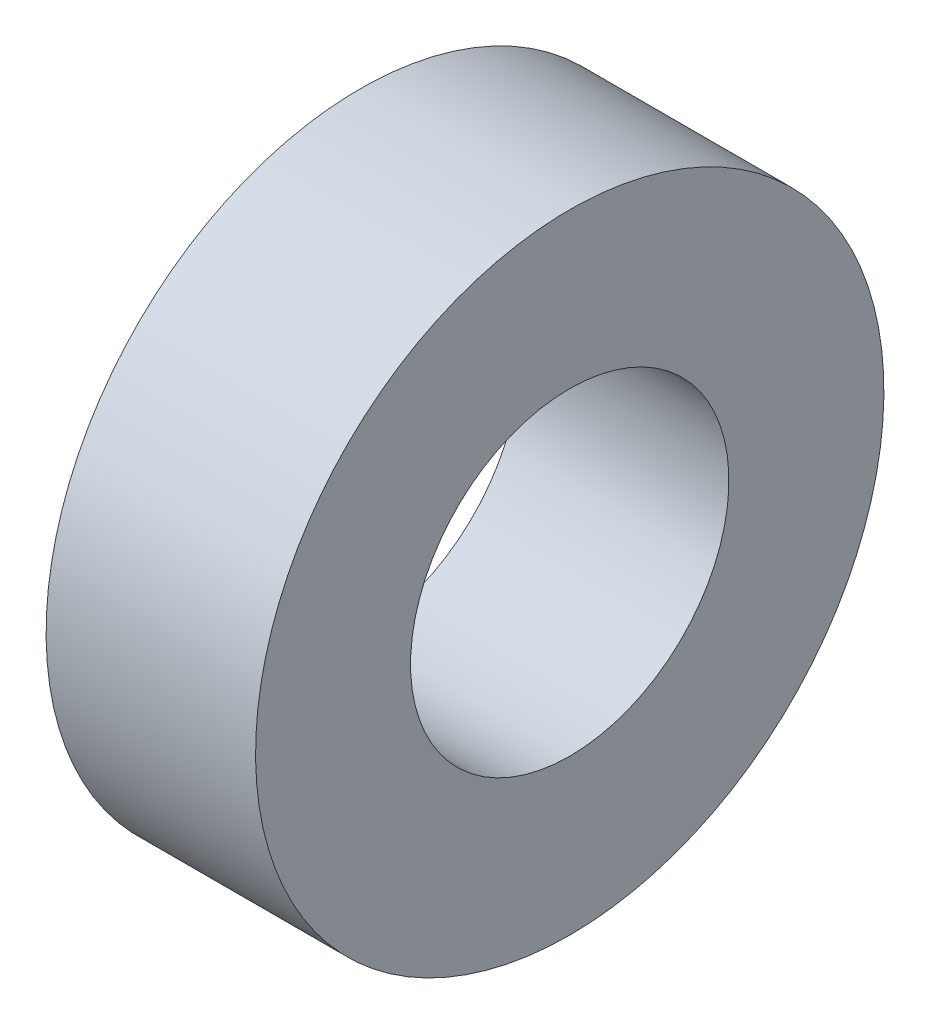
ISO-10303-21;
HEADER;
FILE_DESCRIPTION(('STEP AP214'),'2;1');
FILE_NAME('part.step','',(''),(''),'','','');
FILE_SCHEMA(('AUTOMOTIVE_DESIGN { 1 0 10303 214 1 1 1 1 }'));
ENDSEC;
DATA;
#1=APPLICATION_CONTEXT('core data for automotive mechanical design processes');
#2=APPLICATION_PROTOCOL_DEFINITION('international standard','automotive_design',2000,#1);
#3=PRODUCT_CONTEXT('',#1,'mechanical');
#4=PRODUCT('Part','Part','',(#3));
#5=PRODUCT_RELATED_PRODUCT_CATEGORY('part','',(#4));
#6=PRODUCT_DEFINITION_FORMATION('','',#4);
#7=PRODUCT_DEFINITION_CONTEXT('part definition',#1,'design');
#8=PRODUCT_DEFINITION('design','',#6,#7);
#9=PRODUCT_DEFINITION_SHAPE('','',#8);
#10=(LENGTH_UNIT() NAMED_UNIT(*) SI_UNIT(.MILLI.,.METRE.));
#11=(NAMED_UNIT(*) PLANE_ANGLE_UNIT() SI_UNIT($,.RADIAN.));
#12=(NAMED_UNIT(*) SI_UNIT($,.STERADIAN.) SOLID_ANGLE_UNIT());
#13=UNCERTAINTY_MEASURE_WITH_UNIT(LENGTH_MEASURE(1.E-05),#10,'distance_accuracy_value','');
#14=(GEOMETRIC_REPRESENTATION_CONTEXT(3) GLOBAL_UNCERTAINTY_ASSIGNED_CONTEXT((#13)) GLOBAL_UNIT_ASSIGNED_CONTEXT((#10,
#11,#12)) REPRESENTATION_CONTEXT('',''));
#15=CARTESIAN_POINT('',(0.,0.,0.));
#16=DIRECTION('',(0.,0.,1.));
#17=DIRECTION('',(1.,0.,0.));
#18=AXIS2_PLACEMENT_3D('',#15,#16,#17);
#19=CARTESIAN_POINT('',(0.,4.7625,0.));
#20=DIRECTION('',(1.,0.,0.));
#21=DIRECTION('',(0.,1.,0.));
#22=AXIS2_PLACEMENT_3D('',#19,#20,#21);
#23=PLANE('',#22);
#24=CARTESIAN_POINT('',(0.,0.,0.));
#25=DIRECTION('',(-1.,0.,0.));
#26=DIRECTION('',(0.,-1.,0.));
#27=AXIS2_PLACEMENT_3D('',#24,#25,#26);
#28=CIRCLE('',#27,2.413);
#29=CARTESIAN_POINT('',(0.,-2.413,0.));
#30=VERTEX_POINT('',#29);
#31=EDGE_CURVE('E10',#30,#30,#28,.T.);
#32=ORIENTED_EDGE('',*,*,#31,.F.);
#33=EDGE_LOOP('',(#32));
#34=FACE_BOUND('',#33,.T.);
#35=CARTESIAN_POINT('',(0.,0.,0.));
#36=DIRECTION('',(-1.,0.,0.));
#37=DIRECTION('',(0.,-1.,0.));
#38=AXIS2_PLACEMENT_3D('',#35,#36,#37);
#39=CIRCLE('',#38,4.7625);
#40=CARTESIAN_POINT('',(0.,-4.7625,0.));
#41=VERTEX_POINT('',#40);
#42=EDGE_CURVE('E49',#41,#41,#39,.T.);
#43=ORIENTED_EDGE('',*,*,#42,.T.);
#44=EDGE_LOOP('',(#43));
#45=FACE_BOUND('',#44,.T.);
#46=ADVANCED_FACE('F35',(#34,#45),#23,.F.);
#47=CARTESIAN_POINT('',(0.,0.,0.));
#48=DIRECTION('',(-1.,0.,0.));
#49=DIRECTION('',(0.,-1.,0.));
#50=AXIS2_PLACEMENT_3D('',#47,#48,#49);
#51=CYLINDRICAL_SURFACE('',#50,2.413);
#52=CARTESIAN_POINT('',(3.175,0.,0.));
#53=DIRECTION('',(-1.,0.,0.));
#54=DIRECTION('',(0.,-1.,0.));
#55=AXIS2_PLACEMENT_3D('',#52,#53,#54);
#56=CIRCLE('',#55,2.413);
#57=CARTESIAN_POINT('',(3.175,-2.413,0.));
#58=VERTEX_POINT('',#57);
#59=EDGE_CURVE('E41',#58,#58,#56,.T.);
#60=ORIENTED_EDGE('',*,*,#59,.F.);
#61=EDGE_LOOP('',(#60));
#62=FACE_BOUND('',#61,.T.);
#63=ORIENTED_EDGE('',*,*,#31,.T.);
#64=EDGE_LOOP('',(#63));
#65=FACE_BOUND('',#64,.T.);
#66=ADVANCED_FACE('F64',(#62,#65),#51,.F.);
#67=CARTESIAN_POINT('',(3.175,4.7625,0.));
#68=DIRECTION('',(-1.,0.,0.));
#69=DIRECTION('',(0.,-1.,0.));
#70=AXIS2_PLACEMENT_3D('',#67,#68,#69);
#71=PLANE('',#70);
#72=CARTESIAN_POINT('',(3.175,0.,0.));
#73=DIRECTION('',(-1.,0.,0.));
#74=DIRECTION('',(0.,-1.,0.));
#75=AXIS2_PLACEMENT_3D('',#72,#73,#74);
#76=CIRCLE('',#75,4.7625);
#77=CARTESIAN_POINT('',(3.175,-4.7625,0.));
#78=VERTEX_POINT('',#77);
#79=EDGE_CURVE('E45',#78,#78,#76,.T.);
#80=ORIENTED_EDGE('',*,*,#79,.F.);
#81=EDGE_LOOP('',(#80));
#82=FACE_BOUND('',#81,.T.);
#83=ORIENTED_EDGE('',*,*,#59,.T.);
#84=EDGE_LOOP('',(#83));
#85=FACE_BOUND('',#84,.T.);
#86=ADVANCED_FACE('F59',(#82,#85),#71,.F.);
#87=CARTESIAN_POINT('',(0.,0.,0.));
#88=DIRECTION('',(-1.,0.,0.));
#89=DIRECTION('',(0.,-1.,0.));
#90=AXIS2_PLACEMENT_3D('',#87,#88,#89);
#91=CYLINDRICAL_SURFACE('',#90,4.7625);
#92=ORIENTED_EDGE('',*,*,#42,.F.);
#93=EDGE_LOOP('',(#92));
#94=FACE_BOUND('',#93,.T.);
#95=ORIENTED_EDGE('',*,*,#79,.T.);
#96=EDGE_LOOP('',(#95));
#97=FACE_BOUND('',#96,.T.);
#98=ADVANCED_FACE('F56',(#94,#97),#91,.T.);
#99=CLOSED_SHELL('',(#46,#66,#86,#98));
#100=MANIFOLD_SOLID_BREP('B2',#99);
#101=ADVANCED_BREP_SHAPE_REPRESENTATION('',(#18,#100),#14);
#102=SHAPE_DEFINITION_REPRESENTATION(#9,#101);
ENDSEC;
END-ISO-10303-21;
